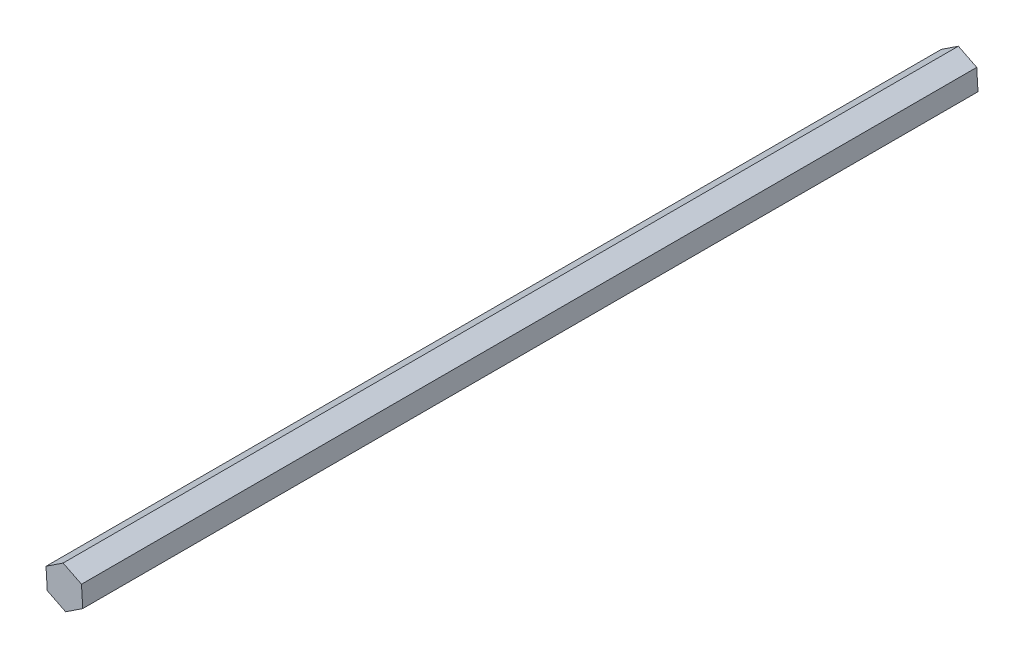
ISO-10303-21;
HEADER;
FILE_DESCRIPTION(('STEP AP214'),'2;1');
FILE_NAME('part.step','',(''),(''),'','','');
FILE_SCHEMA(('AUTOMOTIVE_DESIGN { 1 0 10303 214 1 1 1 1 }'));
ENDSEC;
DATA;
#1=APPLICATION_CONTEXT('core data for automotive mechanical design processes');
#2=APPLICATION_PROTOCOL_DEFINITION('international standard','automotive_design',2000,#1);
#3=PRODUCT_CONTEXT('',#1,'mechanical');
#4=PRODUCT('Part','Part','',(#3));
#5=PRODUCT_RELATED_PRODUCT_CATEGORY('part','',(#4));
#6=PRODUCT_DEFINITION_FORMATION('','',#4);
#7=PRODUCT_DEFINITION_CONTEXT('part definition',#1,'design');
#8=PRODUCT_DEFINITION('design','',#6,#7);
#9=PRODUCT_DEFINITION_SHAPE('','',#8);
#10=(LENGTH_UNIT() NAMED_UNIT(*) SI_UNIT(.MILLI.,.METRE.));
#11=(NAMED_UNIT(*) PLANE_ANGLE_UNIT() SI_UNIT($,.RADIAN.));
#12=(NAMED_UNIT(*) SI_UNIT($,.STERADIAN.) SOLID_ANGLE_UNIT());
#13=UNCERTAINTY_MEASURE_WITH_UNIT(LENGTH_MEASURE(1.E-05),#10,'distance_accuracy_value','');
#14=(GEOMETRIC_REPRESENTATION_CONTEXT(3) GLOBAL_UNCERTAINTY_ASSIGNED_CONTEXT((#13)) GLOBAL_UNIT_ASSIGNED_CONTEXT((#10,
#11,#12)) REPRESENTATION_CONTEXT('',''));
#15=CARTESIAN_POINT('',(0.,0.,0.));
#16=DIRECTION('',(0.,0.,1.));
#17=DIRECTION('',(1.,0.,0.));
#18=AXIS2_PLACEMENT_3D('',#15,#16,#17);
#19=CARTESIAN_POINT('',(6.12625840732226,4.0609676096607,320.55));
#20=DIRECTION('',(-0.445579810348125,-0.895242220077968,0.));
#21=DIRECTION('',(0.895242220077968,-0.445579810348125,0.));
#22=AXIS2_PLACEMENT_3D('',#19,#20,#21);
#23=PLANE('',#22);
#24=DIRECTION('',(-0.895242220077968,0.445579810348125,0.));
#25=VECTOR('',#24,1.);
#26=CARTESIAN_POINT('',(6.12625840732226,4.0609676096607,0.));
#27=LINE('',#26,#25);
#28=CARTESIAN_POINT('',(6.12625840732226,4.0609676096607,0.));
#29=VERTEX_POINT('',#28);
#30=CARTESIAN_POINT('',(-0.453771910250806,7.33597921571942,0.));
#31=VERTEX_POINT('',#30);
#32=EDGE_CURVE('E123',#29,#31,#27,.T.);
#33=ORIENTED_EDGE('',*,*,#32,.T.);
#34=DIRECTION('',(0.,0.,-1.));
#35=VECTOR('',#34,1.);
#36=CARTESIAN_POINT('',(-0.453771910250806,7.33597921571942,320.55));
#37=LINE('',#36,#35);
#38=CARTESIAN_POINT('',(-0.453771910250806,7.33597921571942,320.55));
#39=VERTEX_POINT('',#38);
#40=EDGE_CURVE('E11',#39,#31,#37,.T.);
#41=ORIENTED_EDGE('',*,*,#40,.F.);
#42=DIRECTION('',(-0.895242220077968,0.445579810348125,0.));
#43=VECTOR('',#42,1.);
#44=CARTESIAN_POINT('',(6.12625840732226,4.0609676096607,320.55));
#45=LINE('',#44,#43);
#46=CARTESIAN_POINT('',(6.12625840732226,4.0609676096607,320.55));
#47=VERTEX_POINT('',#46);
#48=EDGE_CURVE('E135',#47,#39,#45,.T.);
#49=ORIENTED_EDGE('',*,*,#48,.F.);
#50=DIRECTION('',(0.,0.,-1.));
#51=VECTOR('',#50,1.);
#52=CARTESIAN_POINT('',(6.12625840732226,4.0609676096607,320.55));
#53=LINE('',#52,#51);
#54=EDGE_CURVE('E118',#47,#29,#53,.T.);
#55=ORIENTED_EDGE('',*,*,#54,.T.);
#56=EDGE_LOOP('',(#33,#41,#49,#55));
#57=FACE_BOUND('',#56,.T.);
#58=ADVANCED_FACE('F39',(#57),#23,.F.);
#59=CARTESIAN_POINT('',(-0.453771910250806,7.33597921571942,320.55));
#60=DIRECTION('',(0.552512599953837,-0.833504545213912,0.));
#61=DIRECTION('',(0.833504545213913,0.552512599953837,0.));
#62=AXIS2_PLACEMENT_3D('',#59,#60,#61);
#63=PLANE('',#62);
#64=DIRECTION('',(-0.833504545213913,-0.552512599953837,0.));
#65=VECTOR('',#64,1.);
#66=CARTESIAN_POINT('',(-0.453771910250806,7.33597921571942,0.));
#67=LINE('',#66,#65);
#68=CARTESIAN_POINT('',(-6.58003031757306,3.27501160605872,0.));
#69=VERTEX_POINT('',#68);
#70=EDGE_CURVE('E127',#31,#69,#67,.T.);
#71=ORIENTED_EDGE('',*,*,#70,.T.);
#72=DIRECTION('',(0.,0.,-1.));
#73=VECTOR('',#72,1.);
#74=CARTESIAN_POINT('',(-6.58003031757306,3.27501160605872,320.55));
#75=LINE('',#74,#73);
#76=CARTESIAN_POINT('',(-6.58003031757306,3.27501160605872,320.55));
#77=VERTEX_POINT('',#76);
#78=EDGE_CURVE('E50',#77,#69,#75,.T.);
#79=ORIENTED_EDGE('',*,*,#78,.F.);
#80=DIRECTION('',(-0.833504545213913,-0.552512599953837,0.));
#81=VECTOR('',#80,1.);
#82=CARTESIAN_POINT('',(-0.453771910250806,7.33597921571942,320.55));
#83=LINE('',#82,#81);
#84=EDGE_CURVE('E95',#39,#77,#83,.T.);
#85=ORIENTED_EDGE('',*,*,#84,.F.);
#86=ORIENTED_EDGE('',*,*,#40,.T.);
#87=EDGE_LOOP('',(#71,#79,#85,#86));
#88=FACE_BOUND('',#87,.T.);
#89=ADVANCED_FACE('F160',(#88),#63,.F.);
#90=CARTESIAN_POINT('',(-6.58003031757306,3.27501160605872,320.55));
#91=DIRECTION('',(0.998092410301962,0.0617376748640551,0.));
#92=DIRECTION('',(-0.0617376748640551,0.998092410301962,0.));
#93=AXIS2_PLACEMENT_3D('',#90,#91,#92);
#94=PLANE('',#93);
#95=DIRECTION('',(0.0617376748640551,-0.998092410301962,0.));
#96=VECTOR('',#95,1.);
#97=CARTESIAN_POINT('',(-6.58003031757306,3.27501160605872,0.));
#98=LINE('',#97,#96);
#99=CARTESIAN_POINT('',(-6.12625840732226,-4.0609676096607,0.));
#100=VERTEX_POINT('',#99);
#101=EDGE_CURVE('E126',#69,#100,#98,.T.);
#102=ORIENTED_EDGE('',*,*,#101,.T.);
#103=DIRECTION('',(0.,0.,-1.));
#104=VECTOR('',#103,1.);
#105=CARTESIAN_POINT('',(-6.12625840732226,-4.0609676096607,320.55));
#106=LINE('',#105,#104);
#107=CARTESIAN_POINT('',(-6.12625840732226,-4.0609676096607,320.55));
#108=VERTEX_POINT('',#107);
#109=EDGE_CURVE('E111',#108,#100,#106,.T.);
#110=ORIENTED_EDGE('',*,*,#109,.F.);
#111=DIRECTION('',(0.0617376748640551,-0.998092410301962,0.));
#112=VECTOR('',#111,1.);
#113=CARTESIAN_POINT('',(-6.58003031757306,3.27501160605872,320.55));
#114=LINE('',#113,#112);
#115=EDGE_CURVE('E104',#77,#108,#114,.T.);
#116=ORIENTED_EDGE('',*,*,#115,.F.);
#117=ORIENTED_EDGE('',*,*,#78,.T.);
#118=EDGE_LOOP('',(#102,#110,#116,#117));
#119=FACE_BOUND('',#118,.T.);
#120=ADVANCED_FACE('F137',(#119),#94,.F.);
#121=CARTESIAN_POINT('',(-6.12625840732226,-4.0609676096607,320.55));
#122=DIRECTION('',(0.445579810348126,0.895242220077968,0.));
#123=DIRECTION('',(-0.895242220077968,0.445579810348126,0.));
#124=AXIS2_PLACEMENT_3D('',#121,#122,#123);
#125=PLANE('',#124);
#126=DIRECTION('',(0.895242220077968,-0.445579810348126,0.));
#127=VECTOR('',#126,1.);
#128=CARTESIAN_POINT('',(-6.12625840732226,-4.0609676096607,0.));
#129=LINE('',#128,#127);
#130=CARTESIAN_POINT('',(0.453771910250804,-7.33597921571942,0.));
#131=VERTEX_POINT('',#130);
#132=EDGE_CURVE('E114',#100,#131,#129,.T.);
#133=ORIENTED_EDGE('',*,*,#132,.T.);
#134=DIRECTION('',(0.,0.,-1.));
#135=VECTOR('',#134,1.);
#136=CARTESIAN_POINT('',(0.453771910250804,-7.33597921571942,320.55));
#137=LINE('',#136,#135);
#138=CARTESIAN_POINT('',(0.453771910250804,-7.33597921571942,320.55));
#139=VERTEX_POINT('',#138);
#140=EDGE_CURVE('E109',#139,#131,#137,.T.);
#141=ORIENTED_EDGE('',*,*,#140,.F.);
#142=DIRECTION('',(0.895242220077968,-0.445579810348126,0.));
#143=VECTOR('',#142,1.);
#144=CARTESIAN_POINT('',(-6.12625840732226,-4.0609676096607,320.55));
#145=LINE('',#144,#143);
#146=EDGE_CURVE('E97',#108,#139,#145,.T.);
#147=ORIENTED_EDGE('',*,*,#146,.F.);
#148=ORIENTED_EDGE('',*,*,#109,.T.);
#149=EDGE_LOOP('',(#133,#141,#147,#148));
#150=FACE_BOUND('',#149,.T.);
#151=ADVANCED_FACE('F112',(#150),#125,.F.);
#152=CARTESIAN_POINT('',(0.453771910250804,-7.33597921571942,320.55));
#153=DIRECTION('',(-0.552512599953837,0.833504545213913,0.));
#154=DIRECTION('',(-0.833504545213913,-0.552512599953837,0.));
#155=AXIS2_PLACEMENT_3D('',#152,#153,#154);
#156=PLANE('',#155);
#157=DIRECTION('',(0.833504545213913,0.552512599953837,0.));
#158=VECTOR('',#157,1.);
#159=CARTESIAN_POINT('',(0.453771910250804,-7.33597921571942,0.));
#160=LINE('',#159,#158);
#161=CARTESIAN_POINT('',(6.58003031757306,-3.27501160605872,0.));
#162=VERTEX_POINT('',#161);
#163=EDGE_CURVE('E80',#131,#162,#160,.T.);
#164=ORIENTED_EDGE('',*,*,#163,.T.);
#165=DIRECTION('',(0.,0.,-1.));
#166=VECTOR('',#165,1.);
#167=CARTESIAN_POINT('',(6.58003031757306,-3.27501160605872,320.55));
#168=LINE('',#167,#166);
#169=CARTESIAN_POINT('',(6.58003031757306,-3.27501160605872,320.55));
#170=VERTEX_POINT('',#169);
#171=EDGE_CURVE('E113',#170,#162,#168,.T.);
#172=ORIENTED_EDGE('',*,*,#171,.F.);
#173=DIRECTION('',(0.833504545213913,0.552512599953837,0.));
#174=VECTOR('',#173,1.);
#175=CARTESIAN_POINT('',(0.453771910250804,-7.33597921571942,320.55));
#176=LINE('',#175,#174);
#177=EDGE_CURVE('E103',#139,#170,#176,.T.);
#178=ORIENTED_EDGE('',*,*,#177,.F.);
#179=ORIENTED_EDGE('',*,*,#140,.T.);
#180=EDGE_LOOP('',(#164,#172,#178,#179));
#181=FACE_BOUND('',#180,.T.);
#182=ADVANCED_FACE('F116',(#181),#156,.F.);
#183=CARTESIAN_POINT('',(6.58003031757306,-3.27501160605872,320.55));
#184=DIRECTION('',(-0.998092410301962,-0.0617376748640547,0.));
#185=DIRECTION('',(0.0617376748640547,-0.998092410301962,0.));
#186=AXIS2_PLACEMENT_3D('',#183,#184,#185);
#187=PLANE('',#186);
#188=DIRECTION('',(-0.0617376748640547,0.998092410301962,0.));
#189=VECTOR('',#188,1.);
#190=CARTESIAN_POINT('',(6.58003031757306,-3.27501160605872,0.));
#191=LINE('',#190,#189);
#192=EDGE_CURVE('E82',#162,#29,#191,.T.);
#193=ORIENTED_EDGE('',*,*,#192,.T.);
#194=ORIENTED_EDGE('',*,*,#54,.F.);
#195=DIRECTION('',(-0.0617376748640547,0.998092410301962,0.));
#196=VECTOR('',#195,1.);
#197=CARTESIAN_POINT('',(6.58003031757306,-3.27501160605872,320.55));
#198=LINE('',#197,#196);
#199=EDGE_CURVE('E54',#170,#47,#198,.T.);
#200=ORIENTED_EDGE('',*,*,#199,.F.);
#201=ORIENTED_EDGE('',*,*,#171,.T.);
#202=EDGE_LOOP('',(#193,#194,#200,#201));
#203=FACE_BOUND('',#202,.T.);
#204=ADVANCED_FACE('F148',(#203),#187,.F.);
#205=CARTESIAN_POINT('',(0.,0.,320.55));
#206=DIRECTION('',(0.,0.,1.));
#207=DIRECTION('',(1.,0.,0.));
#208=AXIS2_PLACEMENT_3D('',#205,#206,#207);
#209=PLANE('',#208);
#210=ORIENTED_EDGE('',*,*,#48,.T.);
#211=ORIENTED_EDGE('',*,*,#84,.T.);
#212=ORIENTED_EDGE('',*,*,#115,.T.);
#213=ORIENTED_EDGE('',*,*,#146,.T.);
#214=ORIENTED_EDGE('',*,*,#177,.T.);
#215=ORIENTED_EDGE('',*,*,#199,.T.);
#216=EDGE_LOOP('',(#210,#211,#212,#213,#214,#215));
#217=FACE_BOUND('',#216,.T.);
#218=ADVANCED_FACE('F101',(#217),#209,.T.);
#219=CARTESIAN_POINT('',(0.,0.,0.));
#220=DIRECTION('',(0.,0.,1.));
#221=DIRECTION('',(1.,0.,0.));
#222=AXIS2_PLACEMENT_3D('',#219,#220,#221);
#223=PLANE('',#222);
#224=ORIENTED_EDGE('',*,*,#32,.F.);
#225=ORIENTED_EDGE('',*,*,#192,.F.);
#226=ORIENTED_EDGE('',*,*,#163,.F.);
#227=ORIENTED_EDGE('',*,*,#132,.F.);
#228=ORIENTED_EDGE('',*,*,#101,.F.);
#229=ORIENTED_EDGE('',*,*,#70,.F.);
#230=EDGE_LOOP('',(#224,#225,#226,#227,#228,#229));
#231=FACE_BOUND('',#230,.T.);
#232=ADVANCED_FACE('F142',(#231),#223,.F.);
#233=CLOSED_SHELL('',(#58,#89,#120,#151,#182,#204,#218,#232));
#234=MANIFOLD_SOLID_BREP('B2',#233);
#235=ADVANCED_BREP_SHAPE_REPRESENTATION('',(#18,#234),#14);
#236=SHAPE_DEFINITION_REPRESENTATION(#9,#235);
ENDSEC;
END-ISO-10303-21;
